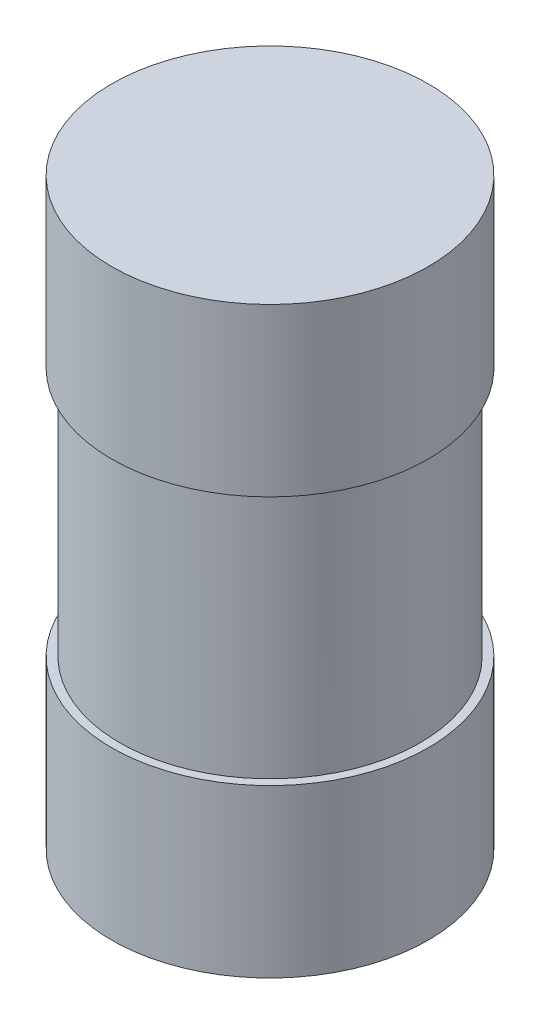
ISO-10303-21;
HEADER;
FILE_DESCRIPTION(('STEP AP214'),'2;1');
FILE_NAME('part.step','',(''),(''),'','','');
FILE_SCHEMA(('AUTOMOTIVE_DESIGN { 1 0 10303 214 1 1 1 1 }'));
ENDSEC;
DATA;
#1=APPLICATION_CONTEXT('core data for automotive mechanical design processes');
#2=APPLICATION_PROTOCOL_DEFINITION('international standard','automotive_design',2000,#1);
#3=PRODUCT_CONTEXT('',#1,'mechanical');
#4=PRODUCT('Part','Part','',(#3));
#5=PRODUCT_RELATED_PRODUCT_CATEGORY('part','',(#4));
#6=PRODUCT_DEFINITION_FORMATION('','',#4);
#7=PRODUCT_DEFINITION_CONTEXT('part definition',#1,'design');
#8=PRODUCT_DEFINITION('design','',#6,#7);
#9=PRODUCT_DEFINITION_SHAPE('','',#8);
#10=(LENGTH_UNIT() NAMED_UNIT(*) SI_UNIT(.MILLI.,.METRE.));
#11=(NAMED_UNIT(*) PLANE_ANGLE_UNIT() SI_UNIT($,.RADIAN.));
#12=(NAMED_UNIT(*) SI_UNIT($,.STERADIAN.) SOLID_ANGLE_UNIT());
#13=UNCERTAINTY_MEASURE_WITH_UNIT(LENGTH_MEASURE(1.E-05),#10,'distance_accuracy_value','');
#14=(GEOMETRIC_REPRESENTATION_CONTEXT(3) GLOBAL_UNCERTAINTY_ASSIGNED_CONTEXT((#13)) GLOBAL_UNIT_ASSIGNED_CONTEXT((#10,
#11,#12)) REPRESENTATION_CONTEXT('',''));
#15=CARTESIAN_POINT('',(0.,0.,0.));
#16=DIRECTION('',(0.,0.,1.));
#17=DIRECTION('',(1.,0.,0.));
#18=AXIS2_PLACEMENT_3D('',#15,#16,#17);
#19=CARTESIAN_POINT('',(0.,35.,0.));
#20=DIRECTION('',(0.,-1.,0.));
#21=DIRECTION('',(0.,0.,-1.));
#22=AXIS2_PLACEMENT_3D('',#19,#20,#21);
#23=CYLINDRICAL_SURFACE('',#22,9.);
#24=CARTESIAN_POINT('',(0.,25.,0.));
#25=DIRECTION('',(0.,1.,0.));
#26=DIRECTION('',(0.,0.,1.));
#27=AXIS2_PLACEMENT_3D('',#24,#25,#26);
#28=CIRCLE('',#27,9.);
#29=CARTESIAN_POINT('',(0.,25.,9.));
#30=VERTEX_POINT('',#29);
#31=EDGE_CURVE('E39',#30,#30,#28,.T.);
#32=ORIENTED_EDGE('',*,*,#31,.F.);
#33=EDGE_LOOP('',(#32));
#34=FACE_BOUND('',#33,.T.);
#35=CARTESIAN_POINT('',(0.,10.,0.));
#36=DIRECTION('',(0.,-1.,0.));
#37=DIRECTION('',(0.,0.,-1.));
#38=AXIS2_PLACEMENT_3D('',#35,#36,#37);
#39=CIRCLE('',#38,9.);
#40=CARTESIAN_POINT('',(0.,10.,-9.));
#41=VERTEX_POINT('',#40);
#42=EDGE_CURVE('E10',#41,#41,#39,.T.);
#43=ORIENTED_EDGE('',*,*,#42,.F.);
#44=EDGE_LOOP('',(#43));
#45=FACE_BOUND('',#44,.T.);
#46=ADVANCED_FACE('F33',(#34,#45),#23,.T.);
#47=CARTESIAN_POINT('',(0.,25.,0.));
#48=DIRECTION('',(0.,1.,0.));
#49=DIRECTION('',(0.,0.,1.));
#50=AXIS2_PLACEMENT_3D('',#47,#48,#49);
#51=CYLINDRICAL_SURFACE('',#50,9.5);
#52=CARTESIAN_POINT('',(0.,25.,0.));
#53=DIRECTION('',(0.,1.,0.));
#54=DIRECTION('',(0.,0.,1.));
#55=AXIS2_PLACEMENT_3D('',#52,#53,#54);
#56=CIRCLE('',#55,9.5);
#57=CARTESIAN_POINT('',(0.,25.,9.5));
#58=VERTEX_POINT('',#57);
#59=EDGE_CURVE('E43',#58,#58,#56,.T.);
#60=ORIENTED_EDGE('',*,*,#59,.T.);
#61=EDGE_LOOP('',(#60));
#62=FACE_BOUND('',#61,.T.);
#63=CARTESIAN_POINT('',(0.,35.,0.));
#64=DIRECTION('',(0.,1.,0.));
#65=DIRECTION('',(0.,0.,1.));
#66=AXIS2_PLACEMENT_3D('',#63,#64,#65);
#67=CIRCLE('',#66,9.5);
#68=CARTESIAN_POINT('',(0.,35.,9.5));
#69=VERTEX_POINT('',#68);
#70=EDGE_CURVE('E47',#69,#69,#67,.T.);
#71=ORIENTED_EDGE('',*,*,#70,.F.);
#72=EDGE_LOOP('',(#71));
#73=FACE_BOUND('',#72,.T.);
#74=ADVANCED_FACE('F74',(#62,#73),#51,.T.);
#75=CARTESIAN_POINT('',(0.,25.,0.));
#76=DIRECTION('',(0.,1.,0.));
#77=DIRECTION('',(0.,0.,1.));
#78=AXIS2_PLACEMENT_3D('',#75,#76,#77);
#79=PLANE('',#78);
#80=ORIENTED_EDGE('',*,*,#31,.T.);
#81=EDGE_LOOP('',(#80));
#82=FACE_BOUND('',#81,.T.);
#83=ORIENTED_EDGE('',*,*,#59,.F.);
#84=EDGE_LOOP('',(#83));
#85=FACE_BOUND('',#84,.T.);
#86=ADVANCED_FACE('F79',(#82,#85),#79,.F.);
#87=CARTESIAN_POINT('',(0.,35.,0.));
#88=DIRECTION('',(0.,1.,0.));
#89=DIRECTION('',(0.,0.,1.));
#90=AXIS2_PLACEMENT_3D('',#87,#88,#89);
#91=PLANE('',#90);
#92=ORIENTED_EDGE('',*,*,#70,.T.);
#93=EDGE_LOOP('',(#92));
#94=FACE_BOUND('',#93,.T.);
#95=ADVANCED_FACE('F71',(#94),#91,.T.);
#96=CARTESIAN_POINT('',(0.,10.,0.));
#97=DIRECTION('',(0.,-1.,0.));
#98=DIRECTION('',(0.,0.,-1.));
#99=AXIS2_PLACEMENT_3D('',#96,#97,#98);
#100=CYLINDRICAL_SURFACE('',#99,9.5);
#101=CARTESIAN_POINT('',(0.,10.,0.));
#102=DIRECTION('',(0.,-1.,0.));
#103=DIRECTION('',(0.,0.,-1.));
#104=AXIS2_PLACEMENT_3D('',#101,#102,#103);
#105=CIRCLE('',#104,9.5);
#106=CARTESIAN_POINT('',(0.,10.,-9.5));
#107=VERTEX_POINT('',#106);
#108=EDGE_CURVE('E51',#107,#107,#105,.T.);
#109=ORIENTED_EDGE('',*,*,#108,.T.);
#110=EDGE_LOOP('',(#109));
#111=FACE_BOUND('',#110,.T.);
#112=CARTESIAN_POINT('',(0.,0.,0.));
#113=DIRECTION('',(0.,-1.,0.));
#114=DIRECTION('',(0.,0.,-1.));
#115=AXIS2_PLACEMENT_3D('',#112,#113,#114);
#116=CIRCLE('',#115,9.5);
#117=CARTESIAN_POINT('',(0.,0.,-9.5));
#118=VERTEX_POINT('',#117);
#119=EDGE_CURVE('E53',#118,#118,#116,.T.);
#120=ORIENTED_EDGE('',*,*,#119,.F.);
#121=EDGE_LOOP('',(#120));
#122=FACE_BOUND('',#121,.T.);
#123=ADVANCED_FACE('F59',(#111,#122),#100,.T.);
#124=CARTESIAN_POINT('',(0.,10.,0.));
#125=DIRECTION('',(0.,-1.,0.));
#126=DIRECTION('',(0.,0.,-1.));
#127=AXIS2_PLACEMENT_3D('',#124,#125,#126);
#128=PLANE('',#127);
#129=ORIENTED_EDGE('',*,*,#42,.T.);
#130=EDGE_LOOP('',(#129));
#131=FACE_BOUND('',#130,.T.);
#132=ORIENTED_EDGE('',*,*,#108,.F.);
#133=EDGE_LOOP('',(#132));
#134=FACE_BOUND('',#133,.T.);
#135=ADVANCED_FACE('F62',(#131,#134),#128,.F.);
#136=CARTESIAN_POINT('',(0.,0.,0.));
#137=DIRECTION('',(0.,1.,0.));
#138=DIRECTION('',(0.,0.,1.));
#139=AXIS2_PLACEMENT_3D('',#136,#137,#138);
#140=PLANE('',#139);
#141=ORIENTED_EDGE('',*,*,#119,.T.);
#142=EDGE_LOOP('',(#141));
#143=FACE_BOUND('',#142,.T.);
#144=ADVANCED_FACE('F64',(#143),#140,.F.);
#145=CLOSED_SHELL('',(#46,#74,#86,#95,#123,#135,#144));
#146=MANIFOLD_SOLID_BREP('B2',#145);
#147=ADVANCED_BREP_SHAPE_REPRESENTATION('',(#18,#146),#14);
#148=SHAPE_DEFINITION_REPRESENTATION(#9,#147);
ENDSEC;
END-ISO-10303-21;
